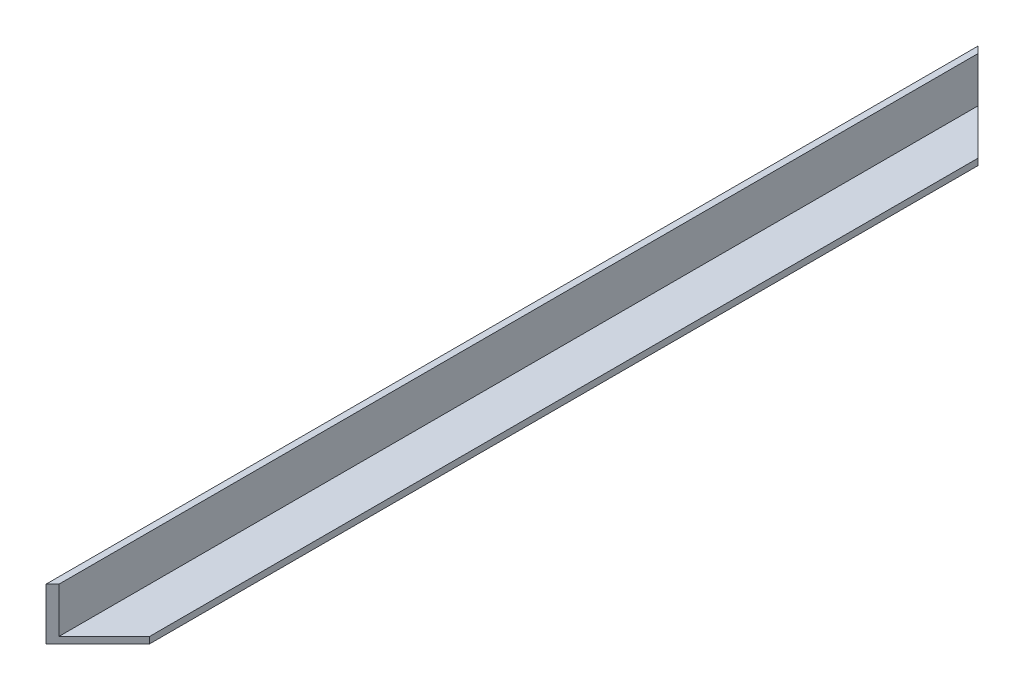
ISO-10303-21;
HEADER;
FILE_DESCRIPTION(('STEP AP214'),'2;1');
FILE_NAME('part.step','',(''),(''),'','','');
FILE_SCHEMA(('AUTOMOTIVE_DESIGN { 1 0 10303 214 1 1 1 1 }'));
ENDSEC;
DATA;
#1=APPLICATION_CONTEXT('core data for automotive mechanical design processes');
#2=APPLICATION_PROTOCOL_DEFINITION('international standard','automotive_design',2000,#1);
#3=PRODUCT_CONTEXT('',#1,'mechanical');
#4=PRODUCT('Part','Part','',(#3));
#5=PRODUCT_RELATED_PRODUCT_CATEGORY('part','',(#4));
#6=PRODUCT_DEFINITION_FORMATION('','',#4);
#7=PRODUCT_DEFINITION_CONTEXT('part definition',#1,'design');
#8=PRODUCT_DEFINITION('design','',#6,#7);
#9=PRODUCT_DEFINITION_SHAPE('','',#8);
#10=(LENGTH_UNIT() NAMED_UNIT(*) SI_UNIT(.MILLI.,.METRE.));
#11=(NAMED_UNIT(*) PLANE_ANGLE_UNIT() SI_UNIT($,.RADIAN.));
#12=(NAMED_UNIT(*) SI_UNIT($,.STERADIAN.) SOLID_ANGLE_UNIT());
#13=UNCERTAINTY_MEASURE_WITH_UNIT(LENGTH_MEASURE(1.E-05),#10,'distance_accuracy_value','');
#14=(GEOMETRIC_REPRESENTATION_CONTEXT(3) GLOBAL_UNCERTAINTY_ASSIGNED_CONTEXT((#13)) GLOBAL_UNIT_ASSIGNED_CONTEXT((#10,
#11,#12)) REPRESENTATION_CONTEXT('',''));
#15=CARTESIAN_POINT('',(0.,0.,0.));
#16=DIRECTION('',(0.,0.,1.));
#17=DIRECTION('',(1.,0.,0.));
#18=AXIS2_PLACEMENT_3D('',#15,#16,#17);
#19=CARTESIAN_POINT('',(0.,25.4,457.2));
#20=DIRECTION('',(1.,0.,0.));
#21=DIRECTION('',(0.,0.,-1.));
#22=AXIS2_PLACEMENT_3D('',#19,#20,#21);
#23=PLANE('',#22);
#24=DIRECTION('',(0.,-1.,0.));
#25=VECTOR('',#24,1.);
#26=CARTESIAN_POINT('',(0.,25.4,0.));
#27=LINE('',#26,#25);
#28=CARTESIAN_POINT('',(0.,25.4,0.));
#29=VERTEX_POINT('',#28);
#30=CARTESIAN_POINT('',(0.,0.,0.));
#31=VERTEX_POINT('',#30);
#32=EDGE_CURVE('E86',#29,#31,#27,.T.);
#33=ORIENTED_EDGE('',*,*,#32,.T.);
#34=DIRECTION('',(0.,0.,-1.));
#35=VECTOR('',#34,1.);
#36=CARTESIAN_POINT('',(0.,0.,457.2));
#37=LINE('',#36,#35);
#38=CARTESIAN_POINT('',(0.,0.,457.2));
#39=VERTEX_POINT('',#38);
#40=EDGE_CURVE('E11',#39,#31,#37,.T.);
#41=ORIENTED_EDGE('',*,*,#40,.F.);
#42=DIRECTION('',(0.,-1.,0.));
#43=VECTOR('',#42,1.);
#44=CARTESIAN_POINT('',(0.,25.4,457.2));
#45=LINE('',#44,#43);
#46=CARTESIAN_POINT('',(0.,25.4,457.2));
#47=VERTEX_POINT('',#46);
#48=EDGE_CURVE('E97',#47,#39,#45,.T.);
#49=ORIENTED_EDGE('',*,*,#48,.F.);
#50=DIRECTION('',(0.,0.,-1.));
#51=VECTOR('',#50,1.);
#52=CARTESIAN_POINT('',(0.,25.4,457.2));
#53=LINE('',#52,#51);
#54=EDGE_CURVE('E103',#47,#29,#53,.T.);
#55=ORIENTED_EDGE('',*,*,#54,.T.);
#56=EDGE_LOOP('',(#33,#41,#49,#55));
#57=FACE_BOUND('',#56,.T.);
#58=ADVANCED_FACE('F38',(#57),#23,.F.);
#59=CARTESIAN_POINT('',(0.,0.,457.2));
#60=DIRECTION('',(0.,1.,0.));
#61=DIRECTION('',(0.,0.,1.));
#62=AXIS2_PLACEMENT_3D('',#59,#60,#61);
#63=PLANE('',#62);
#64=ORIENTED_EDGE('',*,*,#40,.T.);
#65=DIRECTION('',(0.707106781186556,0.,0.707106781186539));
#66=VECTOR('',#65,1.);
#67=CARTESIAN_POINT('',(0.,0.,0.));
#68=LINE('',#67,#66);
#69=CARTESIAN_POINT('',(25.4,0.,25.3999999999994));
#70=VERTEX_POINT('',#69);
#71=EDGE_CURVE('E92',#31,#70,#68,.T.);
#72=ORIENTED_EDGE('',*,*,#71,.T.);
#73=DIRECTION('',(0.,0.,-1.));
#74=VECTOR('',#73,1.);
#75=CARTESIAN_POINT('',(25.4,0.,457.2));
#76=LINE('',#75,#74);
#77=CARTESIAN_POINT('',(25.4,0.,431.8));
#78=VERTEX_POINT('',#77);
#79=EDGE_CURVE('E47',#78,#70,#76,.T.);
#80=ORIENTED_EDGE('',*,*,#79,.F.);
#81=DIRECTION('',(-0.707106781186551,0.,0.707106781186544));
#82=VECTOR('',#81,1.);
#83=CARTESIAN_POINT('',(0.,0.,457.2));
#84=LINE('',#83,#82);
#85=EDGE_CURVE('E136',#78,#39,#84,.T.);
#86=ORIENTED_EDGE('',*,*,#85,.T.);
#87=EDGE_LOOP('',(#64,#72,#80,#86));
#88=FACE_BOUND('',#87,.T.);
#89=ADVANCED_FACE('F135',(#88),#63,.F.);
#90=CARTESIAN_POINT('',(25.4,0.,457.2));
#91=DIRECTION('',(-1.,0.,0.));
#92=DIRECTION('',(0.,0.,1.));
#93=AXIS2_PLACEMENT_3D('',#90,#91,#92);
#94=PLANE('',#93);
#95=ORIENTED_EDGE('',*,*,#79,.T.);
#96=DIRECTION('',(0.,1.,0.));
#97=VECTOR('',#96,1.);
#98=CARTESIAN_POINT('',(25.4,0.,25.3999999999994));
#99=LINE('',#98,#97);
#100=CARTESIAN_POINT('',(25.4,3.175,25.3999999999994));
#101=VERTEX_POINT('',#100);
#102=EDGE_CURVE('E132',#70,#101,#99,.T.);
#103=ORIENTED_EDGE('',*,*,#102,.T.);
#104=DIRECTION('',(0.,0.,-1.));
#105=VECTOR('',#104,1.);
#106=CARTESIAN_POINT('',(25.4,3.175,457.2));
#107=LINE('',#106,#105);
#108=CARTESIAN_POINT('',(25.4,3.175,431.8));
#109=VERTEX_POINT('',#108);
#110=EDGE_CURVE('E121',#109,#101,#107,.T.);
#111=ORIENTED_EDGE('',*,*,#110,.F.);
#112=DIRECTION('',(0.,1.,0.));
#113=VECTOR('',#112,1.);
#114=CARTESIAN_POINT('',(25.4,0.,431.8));
#115=LINE('',#114,#113);
#116=EDGE_CURVE('E108',#78,#109,#115,.T.);
#117=ORIENTED_EDGE('',*,*,#116,.F.);
#118=EDGE_LOOP('',(#95,#103,#111,#117));
#119=FACE_BOUND('',#118,.T.);
#120=ADVANCED_FACE('F130',(#119),#94,.F.);
#121=CARTESIAN_POINT('',(25.4,3.175,457.2));
#122=DIRECTION('',(0.,-1.,0.));
#123=DIRECTION('',(1.,0.,0.));
#124=AXIS2_PLACEMENT_3D('',#121,#122,#123);
#125=PLANE('',#124);
#126=ORIENTED_EDGE('',*,*,#110,.T.);
#127=DIRECTION('',(-0.707106781186556,0.,-0.707106781186539));
#128=VECTOR('',#127,1.);
#129=CARTESIAN_POINT('',(241.3,3.17500000000003,241.299999999994));
#130=LINE('',#129,#128);
#131=CARTESIAN_POINT('',(3.175,3.175,3.17499999999993));
#132=VERTEX_POINT('',#131);
#133=EDGE_CURVE('E151',#101,#132,#130,.T.);
#134=ORIENTED_EDGE('',*,*,#133,.T.);
#135=DIRECTION('',(0.,0.,-1.));
#136=VECTOR('',#135,1.);
#137=CARTESIAN_POINT('',(3.175,3.175,457.2));
#138=LINE('',#137,#136);
#139=CARTESIAN_POINT('',(3.175,3.175,454.025));
#140=VERTEX_POINT('',#139);
#141=EDGE_CURVE('E114',#140,#132,#138,.T.);
#142=ORIENTED_EDGE('',*,*,#141,.F.);
#143=DIRECTION('',(0.707106781186551,0.,-0.707106781186544));
#144=VECTOR('',#143,1.);
#145=CARTESIAN_POINT('',(12.7000000000001,3.175,444.5));
#146=LINE('',#145,#144);
#147=EDGE_CURVE('E98',#140,#109,#146,.T.);
#148=ORIENTED_EDGE('',*,*,#147,.T.);
#149=EDGE_LOOP('',(#126,#134,#142,#148));
#150=FACE_BOUND('',#149,.T.);
#151=ADVANCED_FACE('F163',(#150),#125,.F.);
#152=CARTESIAN_POINT('',(3.175,3.175,457.2));
#153=DIRECTION('',(-1.,0.,0.));
#154=DIRECTION('',(0.,-1.,0.));
#155=AXIS2_PLACEMENT_3D('',#152,#153,#154);
#156=PLANE('',#155);
#157=ORIENTED_EDGE('',*,*,#141,.T.);
#158=DIRECTION('',(0.,1.,0.));
#159=VECTOR('',#158,1.);
#160=CARTESIAN_POINT('',(3.175,3.17500000000002,3.17499999999993));
#161=LINE('',#160,#159);
#162=CARTESIAN_POINT('',(3.17499999999995,25.4,3.17499999999988));
#163=VERTEX_POINT('',#162);
#164=EDGE_CURVE('E140',#132,#163,#161,.T.);
#165=ORIENTED_EDGE('',*,*,#164,.T.);
#166=DIRECTION('',(0.,0.,-1.));
#167=VECTOR('',#166,1.);
#168=CARTESIAN_POINT('',(3.175,25.4,457.2));
#169=LINE('',#168,#167);
#170=CARTESIAN_POINT('',(3.175,25.4,454.025));
#171=VERTEX_POINT('',#170);
#172=EDGE_CURVE('E106',#171,#163,#169,.T.);
#173=ORIENTED_EDGE('',*,*,#172,.F.);
#174=DIRECTION('',(0.,-1.,0.));
#175=VECTOR('',#174,1.);
#176=CARTESIAN_POINT('',(3.175,3.175,454.025));
#177=LINE('',#176,#175);
#178=EDGE_CURVE('E155',#171,#140,#177,.T.);
#179=ORIENTED_EDGE('',*,*,#178,.T.);
#180=EDGE_LOOP('',(#157,#165,#173,#179));
#181=FACE_BOUND('',#180,.T.);
#182=ADVANCED_FACE('F166',(#181),#156,.F.);
#183=CARTESIAN_POINT('',(3.175,25.4,457.2));
#184=DIRECTION('',(0.,-1.,0.));
#185=DIRECTION('',(0.,0.,-1.));
#186=AXIS2_PLACEMENT_3D('',#183,#184,#185);
#187=PLANE('',#186);
#188=ORIENTED_EDGE('',*,*,#172,.T.);
#189=DIRECTION('',(0.707106781186556,0.,0.707106781186539));
#190=VECTOR('',#189,1.);
#191=CARTESIAN_POINT('',(0.,25.4,0.));
#192=LINE('',#191,#190);
#193=EDGE_CURVE('E89',#29,#163,#192,.T.);
#194=ORIENTED_EDGE('',*,*,#193,.F.);
#195=ORIENTED_EDGE('',*,*,#54,.F.);
#196=DIRECTION('',(-0.707106781186551,0.,0.707106781186544));
#197=VECTOR('',#196,1.);
#198=CARTESIAN_POINT('',(0.,25.4,457.2));
#199=LINE('',#198,#197);
#200=EDGE_CURVE('E53',#171,#47,#199,.T.);
#201=ORIENTED_EDGE('',*,*,#200,.F.);
#202=EDGE_LOOP('',(#188,#194,#195,#201));
#203=FACE_BOUND('',#202,.T.);
#204=ADVANCED_FACE('F102',(#203),#187,.F.);
#205=CARTESIAN_POINT('',(0.,0.,0.));
#206=DIRECTION('',(-0.707106781186539,0.,0.707106781186556));
#207=DIRECTION('',(0.707106781186556,0.,0.707106781186539));
#208=AXIS2_PLACEMENT_3D('',#205,#206,#207);
#209=PLANE('',#208);
#210=ORIENTED_EDGE('',*,*,#102,.F.);
#211=ORIENTED_EDGE('',*,*,#71,.F.);
#212=ORIENTED_EDGE('',*,*,#32,.F.);
#213=ORIENTED_EDGE('',*,*,#193,.T.);
#214=ORIENTED_EDGE('',*,*,#164,.F.);
#215=ORIENTED_EDGE('',*,*,#133,.F.);
#216=EDGE_LOOP('',(#210,#211,#212,#213,#214,#215));
#217=FACE_BOUND('',#216,.T.);
#218=ADVANCED_FACE('F88',(#217),#209,.F.);
#219=CARTESIAN_POINT('',(0.,0.,457.2));
#220=DIRECTION('',(-0.707106781186544,0.,-0.707106781186551));
#221=DIRECTION('',(-0.707106781186551,0.,0.707106781186544));
#222=AXIS2_PLACEMENT_3D('',#219,#220,#221);
#223=PLANE('',#222);
#224=ORIENTED_EDGE('',*,*,#178,.F.);
#225=ORIENTED_EDGE('',*,*,#200,.T.);
#226=ORIENTED_EDGE('',*,*,#48,.T.);
#227=ORIENTED_EDGE('',*,*,#85,.F.);
#228=ORIENTED_EDGE('',*,*,#116,.T.);
#229=ORIENTED_EDGE('',*,*,#147,.F.);
#230=EDGE_LOOP('',(#224,#225,#226,#227,#228,#229));
#231=FACE_BOUND('',#230,.T.);
#232=ADVANCED_FACE('F164',(#231),#223,.F.);
#233=CLOSED_SHELL('',(#58,#89,#120,#151,#182,#204,#218,#232));
#234=MANIFOLD_SOLID_BREP('B2',#233);
#235=ADVANCED_BREP_SHAPE_REPRESENTATION('',(#18,#234),#14);
#236=SHAPE_DEFINITION_REPRESENTATION(#9,#235);
ENDSEC;
END-ISO-10303-21;
